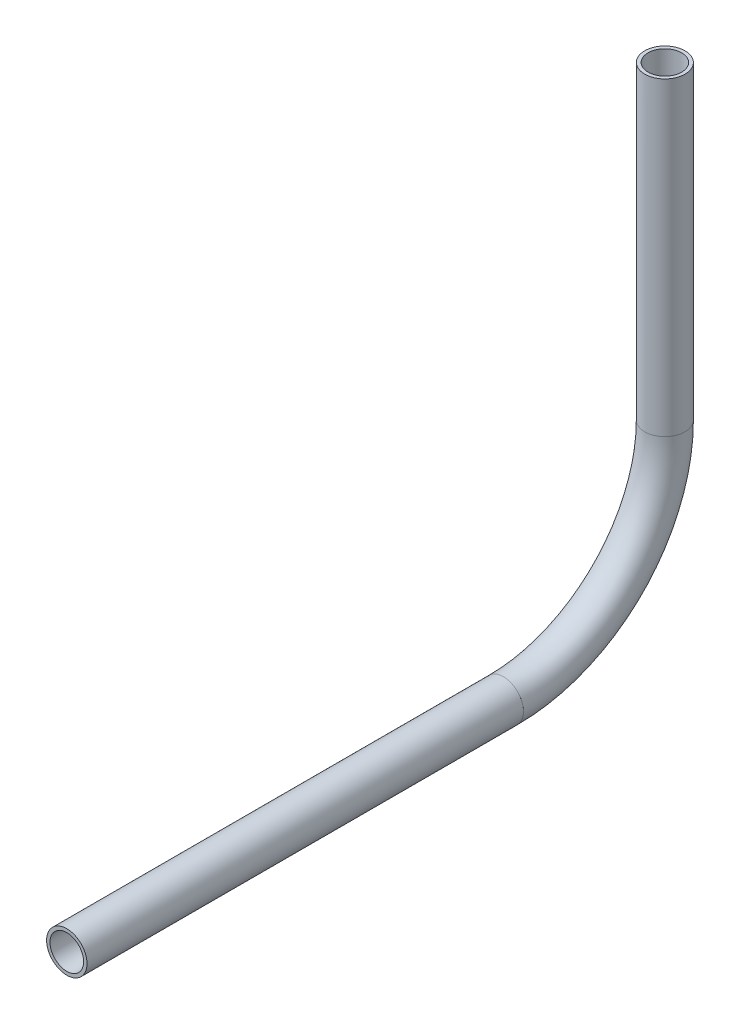
ISO-10303-21;
HEADER;
FILE_DESCRIPTION(('STEP AP214'),'2;1');
FILE_NAME('part.step','',(''),(''),'','','');
FILE_SCHEMA(('AUTOMOTIVE_DESIGN { 1 0 10303 214 1 1 1 1 }'));
ENDSEC;
DATA;
#1=APPLICATION_CONTEXT('core data for automotive mechanical design processes');
#2=APPLICATION_PROTOCOL_DEFINITION('international standard','automotive_design',2000,#1);
#3=PRODUCT_CONTEXT('',#1,'mechanical');
#4=PRODUCT('Part','Part','',(#3));
#5=PRODUCT_RELATED_PRODUCT_CATEGORY('part','',(#4));
#6=PRODUCT_DEFINITION_FORMATION('','',#4);
#7=PRODUCT_DEFINITION_CONTEXT('part definition',#1,'design');
#8=PRODUCT_DEFINITION('design','',#6,#7);
#9=PRODUCT_DEFINITION_SHAPE('','',#8);
#10=(LENGTH_UNIT() NAMED_UNIT(*) SI_UNIT(.MILLI.,.METRE.));
#11=(NAMED_UNIT(*) PLANE_ANGLE_UNIT() SI_UNIT($,.RADIAN.));
#12=(NAMED_UNIT(*) SI_UNIT($,.STERADIAN.) SOLID_ANGLE_UNIT());
#13=UNCERTAINTY_MEASURE_WITH_UNIT(LENGTH_MEASURE(1.E-05),#10,'distance_accuracy_value','');
#14=(GEOMETRIC_REPRESENTATION_CONTEXT(3) GLOBAL_UNCERTAINTY_ASSIGNED_CONTEXT((#13)) GLOBAL_UNIT_ASSIGNED_CONTEXT((#10,
#11,#12)) REPRESENTATION_CONTEXT('',''));
#15=CARTESIAN_POINT('',(0.,0.,0.));
#16=DIRECTION('',(0.,0.,1.));
#17=DIRECTION('',(1.,0.,0.));
#18=AXIS2_PLACEMENT_3D('',#15,#16,#17);
#19=CARTESIAN_POINT('',(0.,599.96001927236,165.88748158046));
#20=DIRECTION('',(0.,0.,1.));
#21=DIRECTION('',(1.,0.,0.));
#22=AXIS2_PLACEMENT_3D('',#19,#20,#21);
#23=CYLINDRICAL_SURFACE('',#22,5.28320000000004);
#24=CARTESIAN_POINT('',(0.,599.96001927236,303.16459571102));
#25=DIRECTION('',(0.,0.,-1.));
#26=DIRECTION('',(-1.,0.,0.));
#27=AXIS2_PLACEMENT_3D('',#24,#25,#26);
#28=CIRCLE('',#27,5.28320000000004);
#29=CARTESIAN_POINT('',(-5.28320000000004,599.96001927236,303.16459571102));
#30=VERTEX_POINT('',#29);
#31=EDGE_CURVE('E55',#30,#30,#28,.T.);
#32=ORIENTED_EDGE('',*,*,#31,.F.);
#33=EDGE_LOOP('',(#32));
#34=FACE_BOUND('',#33,.T.);
#35=CARTESIAN_POINT('',(0.,599.96001927236,165.88748158046));
#36=DIRECTION('',(0.,0.,-1.));
#37=DIRECTION('',(-1.,0.,0.));
#38=AXIS2_PLACEMENT_3D('',#35,#36,#37);
#39=CIRCLE('',#38,5.28320000000004);
#40=CARTESIAN_POINT('',(-5.28320000000004,599.96001927236,165.88748158046));
#41=VERTEX_POINT('',#40);
#42=EDGE_CURVE('E51',#41,#41,#39,.T.);
#43=ORIENTED_EDGE('',*,*,#42,.T.);
#44=EDGE_LOOP('',(#43));
#45=FACE_BOUND('',#44,.T.);
#46=ADVANCED_FACE('F47',(#34,#45),#23,.F.);
#47=CARTESIAN_POINT('',(0.,599.96001927236,165.88748158046));
#48=DIRECTION('',(0.,0.,1.));
#49=DIRECTION('',(1.,0.,0.));
#50=AXIS2_PLACEMENT_3D('',#47,#48,#49);
#51=CYLINDRICAL_SURFACE('',#50,6.35000000000005);
#52=CARTESIAN_POINT('',(0.,599.96001927236,303.16459571102));
#53=DIRECTION('',(0.,0.,-1.));
#54=DIRECTION('',(-1.,0.,0.));
#55=AXIS2_PLACEMENT_3D('',#52,#53,#54);
#56=CIRCLE('',#55,6.35000000000005);
#57=CARTESIAN_POINT('',(-6.35000000000005,599.96001927236,303.16459571102));
#58=VERTEX_POINT('',#57);
#59=EDGE_CURVE('E59',#58,#58,#56,.T.);
#60=ORIENTED_EDGE('',*,*,#59,.T.);
#61=EDGE_LOOP('',(#60));
#62=FACE_BOUND('',#61,.T.);
#63=CARTESIAN_POINT('',(0.,599.96001927236,165.88748158046));
#64=DIRECTION('',(0.,0.,-1.));
#65=DIRECTION('',(-1.,0.,0.));
#66=AXIS2_PLACEMENT_3D('',#63,#64,#65);
#67=CIRCLE('',#66,6.35000000000005);
#68=CARTESIAN_POINT('',(-6.35000000000005,599.96001927236,165.88748158046));
#69=VERTEX_POINT('',#68);
#70=EDGE_CURVE('E12',#69,#69,#67,.T.);
#71=ORIENTED_EDGE('',*,*,#70,.F.);
#72=EDGE_LOOP('',(#71));
#73=FACE_BOUND('',#72,.T.);
#74=ADVANCED_FACE('F74',(#62,#73),#51,.T.);
#75=CARTESIAN_POINT('',(0.,599.96001927236,303.16459571102));
#76=DIRECTION('',(0.,0.,-1.));
#77=DIRECTION('',(-1.,0.,0.));
#78=AXIS2_PLACEMENT_3D('',#75,#76,#77);
#79=PLANE('',#78);
#80=ORIENTED_EDGE('',*,*,#31,.T.);
#81=EDGE_LOOP('',(#80));
#82=FACE_BOUND('',#81,.T.);
#83=ORIENTED_EDGE('',*,*,#59,.F.);
#84=EDGE_LOOP('',(#83));
#85=FACE_BOUND('',#84,.T.);
#86=ADVANCED_FACE('F70',(#82,#85),#79,.F.);
#87=CARTESIAN_POINT('',(0.,599.96001927236,165.88748158046));
#88=DIRECTION('',(0.,0.,-1.));
#89=DIRECTION('',(-1.,0.,0.));
#90=AXIS2_PLACEMENT_3D('',#87,#88,#89);
#91=PLANE('',#90);
#92=ORIENTED_EDGE('',*,*,#42,.F.);
#93=EDGE_LOOP('',(#92));
#94=FACE_BOUND('',#93,.T.);
#95=ORIENTED_EDGE('',*,*,#70,.T.);
#96=EDGE_LOOP('',(#95));
#97=FACE_BOUND('',#96,.T.);
#98=ADVANCED_FACE('F49',(#94,#97),#91,.T.);
#99=CLOSED_SHELL('',(#46,#74,#86,#98));
#100=MANIFOLD_SOLID_BREP('B2',#99);
#101=CARTESIAN_POINT('',(0.,650.76001927236,165.88748158046));
#102=DIRECTION('',(-1.,0.,0.));
#103=DIRECTION('',(0.,0.,1.));
#104=AXIS2_PLACEMENT_3D('',#101,#102,#103);
#105=TOROIDAL_SURFACE('',#104,50.8,5.28320000000004);
#106=CARTESIAN_POINT('',(0.,650.76001927236,115.08748158046));
#107=DIRECTION('',(0.,1.,0.));
#108=DIRECTION('',(0.,0.,1.));
#109=AXIS2_PLACEMENT_3D('',#106,#107,#108);
#110=CIRCLE('',#109,5.28320000000004);
#111=CARTESIAN_POINT('',(0.,650.76001927236,109.80428158046));
#112=VERTEX_POINT('',#111);
#113=EDGE_CURVE('E150',#112,#112,#110,.T.);
#114=CARTESIAN_POINT('',(0.,599.96001927236,165.88748158046));
#115=DIRECTION('',(0.,0.,1.));
#116=DIRECTION('',(1.,0.,0.));
#117=AXIS2_PLACEMENT_3D('',#114,#115,#116);
#118=CIRCLE('',#117,5.28320000000004);
#119=CARTESIAN_POINT('',(0.,594.67681927236,165.88748158046));
#120=VERTEX_POINT('',#119);
#121=EDGE_CURVE('E140',#120,#120,#118,.T.);
#122=CARTESIAN_POINT('',(0.,650.76001927236,165.88748158046));
#123=DIRECTION('',(-1.,0.,0.));
#124=DIRECTION('',(0.,0.,1.));
#125=AXIS2_PLACEMENT_3D('',#122,#123,#124);
#126=CIRCLE('',#125,56.0832000000001);
#127=EDGE_CURVE('',#112,#120,#126,.T.);
#128=ORIENTED_EDGE('',*,*,#113,.T.);
#129=ORIENTED_EDGE('',*,*,#121,.T.);
#130=ORIENTED_EDGE('',*,*,#127,.T.);
#131=ORIENTED_EDGE('',*,*,#127,.F.);
#132=EDGE_LOOP('',(#128,#130,#129,#131));
#133=FACE_BOUND('',#132,.T.);
#134=ADVANCED_FACE('F136',(#133),#105,.F.);
#135=CARTESIAN_POINT('',(0.,650.76001927236,165.88748158046));
#136=DIRECTION('',(-1.,0.,0.));
#137=DIRECTION('',(0.,0.,1.));
#138=AXIS2_PLACEMENT_3D('',#135,#136,#137);
#139=TOROIDAL_SURFACE('',#138,50.8,6.35000000000005);
#140=CARTESIAN_POINT('',(0.,650.76001927236,115.08748158046));
#141=DIRECTION('',(0.,1.,0.));
#142=DIRECTION('',(0.,0.,1.));
#143=AXIS2_PLACEMENT_3D('',#140,#141,#142);
#144=CIRCLE('',#143,6.35000000000005);
#145=CARTESIAN_POINT('',(0.,650.76001927236,108.73748158046));
#146=VERTEX_POINT('',#145);
#147=EDGE_CURVE('E144',#146,#146,#144,.T.);
#148=CARTESIAN_POINT('',(0.,599.96001927236,165.88748158046));
#149=DIRECTION('',(0.,0.,1.));
#150=DIRECTION('',(1.,0.,0.));
#151=AXIS2_PLACEMENT_3D('',#148,#149,#150);
#152=CIRCLE('',#151,6.35000000000005);
#153=CARTESIAN_POINT('',(0.,593.61001927236,165.88748158046));
#154=VERTEX_POINT('',#153);
#155=EDGE_CURVE('E46',#154,#154,#152,.T.);
#156=CARTESIAN_POINT('',(0.,650.76001927236,165.88748158046));
#157=DIRECTION('',(-1.,0.,0.));
#158=DIRECTION('',(0.,0.,1.));
#159=AXIS2_PLACEMENT_3D('',#156,#157,#158);
#160=CIRCLE('',#159,57.1500000000001);
#161=EDGE_CURVE('',#146,#154,#160,.T.);
#162=ORIENTED_EDGE('',*,*,#147,.F.);
#163=ORIENTED_EDGE('',*,*,#155,.F.);
#164=ORIENTED_EDGE('',*,*,#161,.T.);
#165=ORIENTED_EDGE('',*,*,#161,.F.);
#166=EDGE_LOOP('',(#162,#164,#163,#165));
#167=FACE_BOUND('',#166,.T.);
#168=ADVANCED_FACE('F163',(#167),#139,.T.);
#169=CARTESIAN_POINT('',(0.,650.76001927236,115.08748158046));
#170=DIRECTION('',(0.,1.,0.));
#171=DIRECTION('',(0.,0.,1.));
#172=AXIS2_PLACEMENT_3D('',#169,#170,#171);
#173=PLANE('',#172);
#174=ORIENTED_EDGE('',*,*,#113,.F.);
#175=EDGE_LOOP('',(#174));
#176=FACE_BOUND('',#175,.T.);
#177=ORIENTED_EDGE('',*,*,#147,.T.);
#178=EDGE_LOOP('',(#177));
#179=FACE_BOUND('',#178,.T.);
#180=ADVANCED_FACE('F159',(#176,#179),#173,.T.);
#181=CARTESIAN_POINT('',(0.,599.96001927236,165.88748158046));
#182=DIRECTION('',(0.,0.,1.));
#183=DIRECTION('',(1.,0.,0.));
#184=AXIS2_PLACEMENT_3D('',#181,#182,#183);
#185=PLANE('',#184);
#186=ORIENTED_EDGE('',*,*,#121,.F.);
#187=EDGE_LOOP('',(#186));
#188=FACE_BOUND('',#187,.T.);
#189=ORIENTED_EDGE('',*,*,#155,.T.);
#190=EDGE_LOOP('',(#189));
#191=FACE_BOUND('',#190,.T.);
#192=ADVANCED_FACE('F138',(#188,#191),#185,.T.);
#193=CLOSED_SHELL('',(#134,#168,#180,#192));
#194=MANIFOLD_SOLID_BREP('B7',#193);
#195=CARTESIAN_POINT('',(0.,748.173816574198,115.08748158046));
#196=DIRECTION('',(0.,-1.,0.));
#197=DIRECTION('',(0.,0.,-1.));
#198=AXIS2_PLACEMENT_3D('',#195,#196,#197);
#199=CYLINDRICAL_SURFACE('',#198,5.28320000000004);
#200=CARTESIAN_POINT('',(0.,748.173816574198,115.08748158046));
#201=DIRECTION('',(0.,1.,0.));
#202=DIRECTION('',(-1.,0.,0.));
#203=AXIS2_PLACEMENT_3D('',#200,#201,#202);
#204=CIRCLE('',#203,5.28320000000004);
#205=CARTESIAN_POINT('',(-5.28320000000004,748.173816574198,115.08748158046));
#206=VERTEX_POINT('',#205);
#207=EDGE_CURVE('E234',#206,#206,#204,.T.);
#208=ORIENTED_EDGE('',*,*,#207,.T.);
#209=EDGE_LOOP('',(#208));
#210=FACE_BOUND('',#209,.T.);
#211=CARTESIAN_POINT('',(0.,650.76001927236,115.08748158046));
#212=DIRECTION('',(0.,-1.,0.));
#213=DIRECTION('',(0.,0.,-1.));
#214=AXIS2_PLACEMENT_3D('',#211,#212,#213);
#215=CIRCLE('',#214,5.28320000000004);
#216=CARTESIAN_POINT('',(0.,650.76001927236,109.80428158046));
#217=VERTEX_POINT('',#216);
#218=EDGE_CURVE('E224',#217,#217,#215,.T.);
#219=ORIENTED_EDGE('',*,*,#218,.T.);
#220=EDGE_LOOP('',(#219));
#221=FACE_BOUND('',#220,.T.);
#222=ADVANCED_FACE('F220',(#210,#221),#199,.F.);
#223=CARTESIAN_POINT('',(0.,748.173816574198,115.08748158046));
#224=DIRECTION('',(0.,-1.,0.));
#225=DIRECTION('',(0.,0.,-1.));
#226=AXIS2_PLACEMENT_3D('',#223,#224,#225);
#227=CYLINDRICAL_SURFACE('',#226,6.35000000000005);
#228=CARTESIAN_POINT('',(0.,748.173816574198,115.08748158046));
#229=DIRECTION('',(0.,1.,0.));
#230=DIRECTION('',(-1.,0.,0.));
#231=AXIS2_PLACEMENT_3D('',#228,#229,#230);
#232=CIRCLE('',#231,6.35000000000005);
#233=CARTESIAN_POINT('',(-6.35000000000005,748.173816574198,115.08748158046));
#234=VERTEX_POINT('',#233);
#235=EDGE_CURVE('E228',#234,#234,#232,.T.);
#236=ORIENTED_EDGE('',*,*,#235,.F.);
#237=EDGE_LOOP('',(#236));
#238=FACE_BOUND('',#237,.T.);
#239=CARTESIAN_POINT('',(0.,650.76001927236,115.08748158046));
#240=DIRECTION('',(0.,-1.,0.));
#241=DIRECTION('',(0.,0.,-1.));
#242=AXIS2_PLACEMENT_3D('',#239,#240,#241);
#243=CIRCLE('',#242,6.35000000000005);
#244=CARTESIAN_POINT('',(0.,650.76001927236,108.73748158046));
#245=VERTEX_POINT('',#244);
#246=EDGE_CURVE('E135',#245,#245,#243,.T.);
#247=ORIENTED_EDGE('',*,*,#246,.F.);
#248=EDGE_LOOP('',(#247));
#249=FACE_BOUND('',#248,.T.);
#250=ADVANCED_FACE('F247',(#238,#249),#227,.T.);
#251=CARTESIAN_POINT('',(0.,748.173816574198,115.08748158046));
#252=DIRECTION('',(0.,1.,0.));
#253=DIRECTION('',(-1.,0.,0.));
#254=AXIS2_PLACEMENT_3D('',#251,#252,#253);
#255=PLANE('',#254);
#256=ORIENTED_EDGE('',*,*,#207,.F.);
#257=EDGE_LOOP('',(#256));
#258=FACE_BOUND('',#257,.T.);
#259=ORIENTED_EDGE('',*,*,#235,.T.);
#260=EDGE_LOOP('',(#259));
#261=FACE_BOUND('',#260,.T.);
#262=ADVANCED_FACE('F243',(#258,#261),#255,.T.);
#263=CARTESIAN_POINT('',(0.,650.76001927236,115.08748158046));
#264=DIRECTION('',(0.,-1.,0.));
#265=DIRECTION('',(0.,0.,-1.));
#266=AXIS2_PLACEMENT_3D('',#263,#264,#265);
#267=PLANE('',#266);
#268=ORIENTED_EDGE('',*,*,#218,.F.);
#269=EDGE_LOOP('',(#268));
#270=FACE_BOUND('',#269,.T.);
#271=ORIENTED_EDGE('',*,*,#246,.T.);
#272=EDGE_LOOP('',(#271));
#273=FACE_BOUND('',#272,.T.);
#274=ADVANCED_FACE('F222',(#270,#273),#267,.T.);
#275=CLOSED_SHELL('',(#222,#250,#262,#274));
#276=MANIFOLD_SOLID_BREP('B41',#275);
#277=ADVANCED_BREP_SHAPE_REPRESENTATION('',(#18,#100,#194,#276),#14);
#278=SHAPE_DEFINITION_REPRESENTATION(#9,#277);
ENDSEC;
END-ISO-10303-21;
